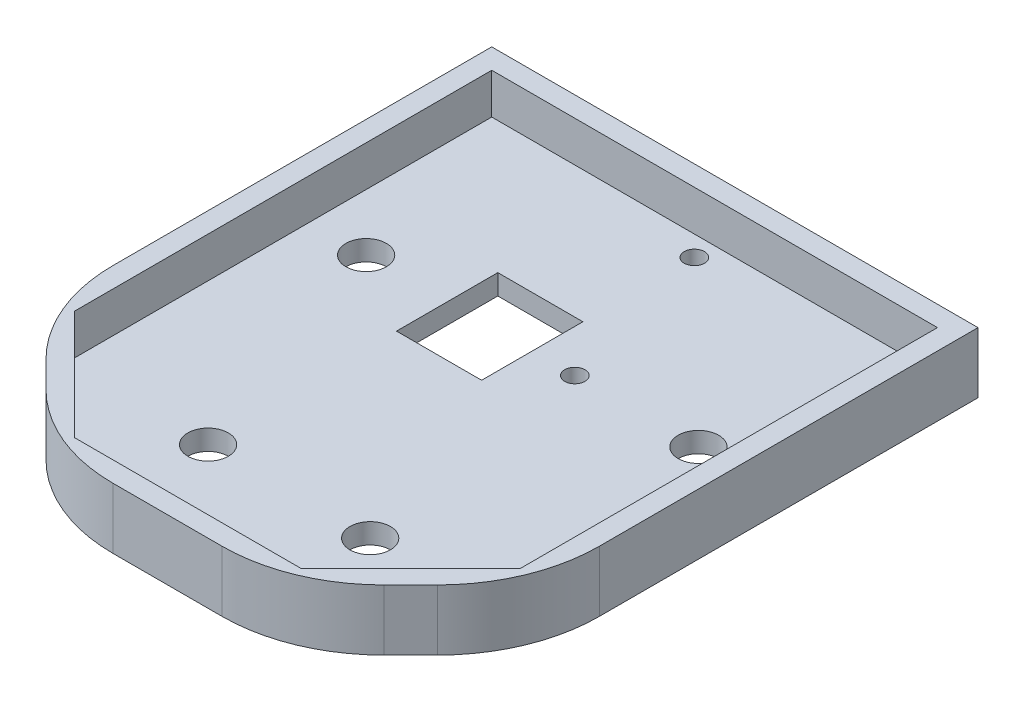
ISO-10303-21;
HEADER;
FILE_DESCRIPTION(('STEP AP214'),'2;1');
FILE_NAME('part.step','',(''),(''),'','','');
FILE_SCHEMA(('AUTOMOTIVE_DESIGN { 1 0 10303 214 1 1 1 1 }'));
ENDSEC;
DATA;
#1=APPLICATION_CONTEXT('core data for automotive mechanical design processes');
#2=APPLICATION_PROTOCOL_DEFINITION('international standard','automotive_design',2000,#1);
#3=PRODUCT_CONTEXT('',#1,'mechanical');
#4=PRODUCT('Part','Part','',(#3));
#5=PRODUCT_RELATED_PRODUCT_CATEGORY('part','',(#4));
#6=PRODUCT_DEFINITION_FORMATION('','',#4);
#7=PRODUCT_DEFINITION_CONTEXT('part definition',#1,'design');
#8=PRODUCT_DEFINITION('design','',#6,#7);
#9=PRODUCT_DEFINITION_SHAPE('','',#8);
#10=(LENGTH_UNIT() NAMED_UNIT(*) SI_UNIT(.MILLI.,.METRE.));
#11=(NAMED_UNIT(*) PLANE_ANGLE_UNIT() SI_UNIT($,.RADIAN.));
#12=(NAMED_UNIT(*) SI_UNIT($,.STERADIAN.) SOLID_ANGLE_UNIT());
#13=UNCERTAINTY_MEASURE_WITH_UNIT(LENGTH_MEASURE(1.E-05),#10,'distance_accuracy_value','');
#14=(GEOMETRIC_REPRESENTATION_CONTEXT(3) GLOBAL_UNCERTAINTY_ASSIGNED_CONTEXT((#13)) GLOBAL_UNIT_ASSIGNED_CONTEXT((#10,
#11,#12)) REPRESENTATION_CONTEXT('',''));
#15=CARTESIAN_POINT('',(0.,0.,0.));
#16=DIRECTION('',(0.,0.,1.));
#17=DIRECTION('',(1.,0.,0.));
#18=AXIS2_PLACEMENT_3D('',#15,#16,#17);
#19=CARTESIAN_POINT('',(0.,6.35,0.));
#20=DIRECTION('',(0.,1.,0.));
#21=DIRECTION('',(0.,0.,1.));
#22=AXIS2_PLACEMENT_3D('',#19,#20,#21);
#23=PLANE('',#22);
#24=DIRECTION('',(1.,0.,0.));
#25=VECTOR('',#24,1.);
#26=CARTESIAN_POINT('',(0.,6.35,-82.55));
#27=LINE('',#26,#25);
#28=CARTESIAN_POINT('',(-69.85,6.35,-82.55));
#29=VERTEX_POINT('',#28);
#30=CARTESIAN_POINT('',(69.85,6.35,-82.55));
#31=VERTEX_POINT('',#30);
#32=EDGE_CURVE('E249',#29,#31,#27,.T.);
#33=ORIENTED_EDGE('',*,*,#32,.F.);
#34=DIRECTION('',(0.,0.,-1.));
#35=VECTOR('',#34,1.);
#36=CARTESIAN_POINT('',(-69.85,6.35,0.));
#37=LINE('',#36,#35);
#38=CARTESIAN_POINT('',(-69.85,6.35,48.1697438789309));
#39=VERTEX_POINT('',#38);
#40=EDGE_CURVE('E193',#39,#29,#37,.T.);
#41=ORIENTED_EDGE('',*,*,#40,.F.);
#42=DIRECTION('',(-0.707106781186547,0.,-0.707106781186548));
#43=VECTOR('',#42,1.);
#44=CARTESIAN_POINT('',(-59.0098719394654,6.35,59.0098719394654));
#45=LINE('',#44,#43);
#46=CARTESIAN_POINT('',(-35.4697438789308,6.35,82.55));
#47=VERTEX_POINT('',#46);
#48=EDGE_CURVE('E245',#47,#39,#45,.T.);
#49=ORIENTED_EDGE('',*,*,#48,.F.);
#50=DIRECTION('',(-1.,0.,0.));
#51=VECTOR('',#50,1.);
#52=CARTESIAN_POINT('',(0.,6.35,82.55));
#53=LINE('',#52,#51);
#54=CARTESIAN_POINT('',(35.4697438789309,6.35,82.55));
#55=VERTEX_POINT('',#54);
#56=EDGE_CURVE('E242',#55,#47,#53,.T.);
#57=ORIENTED_EDGE('',*,*,#56,.F.);
#58=DIRECTION('',(-0.707106781186548,0.,0.707106781186548));
#59=VECTOR('',#58,1.);
#60=CARTESIAN_POINT('',(59.0098719394655,6.35,59.0098719394655));
#61=LINE('',#60,#59);
#62=CARTESIAN_POINT('',(69.85,6.35,48.1697438789309));
#63=VERTEX_POINT('',#62);
#64=EDGE_CURVE('E239',#63,#55,#61,.T.);
#65=ORIENTED_EDGE('',*,*,#64,.F.);
#66=DIRECTION('',(0.,0.,1.));
#67=VECTOR('',#66,1.);
#68=CARTESIAN_POINT('',(69.85,6.35,0.));
#69=LINE('',#68,#67);
#70=EDGE_CURVE('E236',#31,#63,#69,.T.);
#71=ORIENTED_EDGE('',*,*,#70,.F.);
#72=EDGE_LOOP('',(#33,#41,#49,#57,#65,#71));
#73=FACE_BOUND('',#72,.T.);
#74=DIRECTION('',(-1.,0.,0.));
#75=VECTOR('',#74,1.);
#76=CARTESIAN_POINT('',(-26.67,6.35,-41.275));
#77=LINE('',#76,#75);
#78=CARTESIAN_POINT('',(0.,6.35,-41.275));
#79=VERTEX_POINT('',#78);
#80=CARTESIAN_POINT('',(-26.67,6.35,-41.275));
#81=VERTEX_POINT('',#80);
#82=EDGE_CURVE('E260',#79,#81,#77,.T.);
#83=ORIENTED_EDGE('',*,*,#82,.F.);
#84=DIRECTION('',(0.,0.,-1.));
#85=VECTOR('',#84,1.);
#86=CARTESIAN_POINT('',(0.,6.35,-9.52499999999996));
#87=LINE('',#86,#85);
#88=CARTESIAN_POINT('',(0.,6.35,-9.52499999999996));
#89=VERTEX_POINT('',#88);
#90=EDGE_CURVE('E258',#89,#79,#87,.T.);
#91=ORIENTED_EDGE('',*,*,#90,.F.);
#92=DIRECTION('',(1.,0.,0.));
#93=VECTOR('',#92,1.);
#94=CARTESIAN_POINT('',(-26.67,6.35,-9.52499999999996));
#95=LINE('',#94,#93);
#96=CARTESIAN_POINT('',(-26.67,6.35,-9.52499999999996));
#97=VERTEX_POINT('',#96);
#98=EDGE_CURVE('E266',#97,#89,#95,.T.);
#99=ORIENTED_EDGE('',*,*,#98,.F.);
#100=DIRECTION('',(0.,0.,1.));
#101=VECTOR('',#100,1.);
#102=CARTESIAN_POINT('',(-26.67,6.35,-9.52499999999996));
#103=LINE('',#102,#101);
#104=EDGE_CURVE('E263',#81,#97,#103,.T.);
#105=ORIENTED_EDGE('',*,*,#104,.F.);
#106=EDGE_LOOP('',(#83,#91,#99,#105));
#107=FACE_BOUND('',#106,.T.);
#108=CARTESIAN_POINT('',(0.,6.35,-76.1999999999999));
#109=DIRECTION('',(0.,1.,0.));
#110=DIRECTION('',(0.,0.,1.));
#111=AXIS2_PLACEMENT_3D('',#108,#109,#110);
#112=CIRCLE('',#111,3.175);
#113=CARTESIAN_POINT('',(0.,6.35,-73.0249999999999));
#114=VERTEX_POINT('',#113);
#115=EDGE_CURVE('E289',#114,#114,#112,.T.);
#116=ORIENTED_EDGE('',*,*,#115,.F.);
#117=EDGE_LOOP('',(#116));
#118=FACE_BOUND('',#117,.T.);
#119=CARTESIAN_POINT('',(25.4,6.35,50.8));
#120=DIRECTION('',(0.,1.,0.));
#121=DIRECTION('',(0.,0.,1.));
#122=AXIS2_PLACEMENT_3D('',#119,#120,#121);
#123=CIRCLE('',#122,6.35000000000001);
#124=CARTESIAN_POINT('',(25.4,6.35,57.15));
#125=VERTEX_POINT('',#124);
#126=EDGE_CURVE('E301',#125,#125,#123,.T.);
#127=ORIENTED_EDGE('',*,*,#126,.F.);
#128=EDGE_LOOP('',(#127));
#129=FACE_BOUND('',#128,.T.);
#130=CARTESIAN_POINT('',(52.07,6.35,-25.4));
#131=DIRECTION('',(0.,1.,0.));
#132=DIRECTION('',(0.,0.,1.));
#133=AXIS2_PLACEMENT_3D('',#130,#131,#132);
#134=CIRCLE('',#133,6.35);
#135=CARTESIAN_POINT('',(52.07,6.35,-19.05));
#136=VERTEX_POINT('',#135);
#137=EDGE_CURVE('E313',#136,#136,#134,.T.);
#138=ORIENTED_EDGE('',*,*,#137,.F.);
#139=EDGE_LOOP('',(#138));
#140=FACE_BOUND('',#139,.T.);
#141=CARTESIAN_POINT('',(-52.07,6.35,-25.4));
#142=DIRECTION('',(0.,1.,0.));
#143=DIRECTION('',(0.,0.,1.));
#144=AXIS2_PLACEMENT_3D('',#141,#142,#143);
#145=CIRCLE('',#144,6.35);
#146=CARTESIAN_POINT('',(-52.07,6.35,-19.05));
#147=VERTEX_POINT('',#146);
#148=EDGE_CURVE('E319',#147,#147,#145,.T.);
#149=ORIENTED_EDGE('',*,*,#148,.F.);
#150=EDGE_LOOP('',(#149));
#151=FACE_BOUND('',#150,.T.);
#152=CARTESIAN_POINT('',(-25.4,6.35,50.8));
#153=DIRECTION('',(0.,1.,0.));
#154=DIRECTION('',(0.,0.,1.));
#155=AXIS2_PLACEMENT_3D('',#152,#153,#154);
#156=CIRCLE('',#155,6.35);
#157=CARTESIAN_POINT('',(-25.4,6.35,57.15));
#158=VERTEX_POINT('',#157);
#159=EDGE_CURVE('E307',#158,#158,#156,.T.);
#160=ORIENTED_EDGE('',*,*,#159,.F.);
#161=EDGE_LOOP('',(#160));
#162=FACE_BOUND('',#161,.T.);
#163=CARTESIAN_POINT('',(0.,6.35,76.2));
#164=DIRECTION('',(0.,1.,0.));
#165=DIRECTION('',(0.,0.,1.));
#166=AXIS2_PLACEMENT_3D('',#163,#164,#165);
#167=CIRCLE('',#166,3.175);
#168=CARTESIAN_POINT('',(0.,6.35,79.375));
#169=VERTEX_POINT('',#168);
#170=EDGE_CURVE('E295',#169,#169,#167,.T.);
#171=ORIENTED_EDGE('',*,*,#170,.F.);
#172=EDGE_LOOP('',(#171));
#173=FACE_BOUND('',#172,.T.);
#174=CARTESIAN_POINT('',(13.335,6.35,-25.4));
#175=DIRECTION('',(0.,1.,0.));
#176=DIRECTION('',(0.,0.,1.));
#177=AXIS2_PLACEMENT_3D('',#174,#175,#176);
#178=CIRCLE('',#177,3.175);
#179=CARTESIAN_POINT('',(13.335,6.35,-22.225));
#180=VERTEX_POINT('',#179);
#181=EDGE_CURVE('E252',#180,#180,#178,.T.);
#182=ORIENTED_EDGE('',*,*,#181,.F.);
#183=EDGE_LOOP('',(#182));
#184=FACE_BOUND('',#183,.T.);
#185=ADVANCED_FACE('F37',(#73,#107,#118,#129,#140,#151,#162,#173,#184),#23,.T.);
#186=CARTESIAN_POINT('',(0.,0.,0.));
#187=DIRECTION('',(0.,1.,0.));
#188=DIRECTION('',(0.,0.,1.));
#189=AXIS2_PLACEMENT_3D('',#186,#187,#188);
#190=PLANE('',#189);
#191=CARTESIAN_POINT('',(0.,0.,-76.1999999999999));
#192=DIRECTION('',(0.,1.,0.));
#193=DIRECTION('',(0.,0.,1.));
#194=AXIS2_PLACEMENT_3D('',#191,#192,#193);
#195=CIRCLE('',#194,3.175);
#196=CARTESIAN_POINT('',(0.,0.,-73.0249999999999));
#197=VERTEX_POINT('',#196);
#198=EDGE_CURVE('E288',#197,#197,#195,.T.);
#199=ORIENTED_EDGE('',*,*,#198,.T.);
#200=EDGE_LOOP('',(#199));
#201=FACE_BOUND('',#200,.T.);
#202=CARTESIAN_POINT('',(0.,0.,76.2));
#203=DIRECTION('',(0.,1.,0.));
#204=DIRECTION('',(0.,0.,1.));
#205=AXIS2_PLACEMENT_3D('',#202,#203,#204);
#206=CIRCLE('',#205,3.175);
#207=CARTESIAN_POINT('',(0.,0.,79.375));
#208=VERTEX_POINT('',#207);
#209=EDGE_CURVE('E292',#208,#208,#206,.T.);
#210=ORIENTED_EDGE('',*,*,#209,.T.);
#211=EDGE_LOOP('',(#210));
#212=FACE_BOUND('',#211,.T.);
#213=CARTESIAN_POINT('',(25.4,0.,50.8));
#214=DIRECTION('',(0.,1.,0.));
#215=DIRECTION('',(0.,0.,1.));
#216=AXIS2_PLACEMENT_3D('',#213,#214,#215);
#217=CIRCLE('',#216,6.35000000000001);
#218=CARTESIAN_POINT('',(25.4,0.,57.15));
#219=VERTEX_POINT('',#218);
#220=EDGE_CURVE('E298',#219,#219,#217,.T.);
#221=ORIENTED_EDGE('',*,*,#220,.T.);
#222=EDGE_LOOP('',(#221));
#223=FACE_BOUND('',#222,.T.);
#224=CARTESIAN_POINT('',(-25.4,0.,50.8));
#225=DIRECTION('',(0.,1.,0.));
#226=DIRECTION('',(0.,0.,1.));
#227=AXIS2_PLACEMENT_3D('',#224,#225,#226);
#228=CIRCLE('',#227,6.35);
#229=CARTESIAN_POINT('',(-25.4,0.,57.15));
#230=VERTEX_POINT('',#229);
#231=EDGE_CURVE('E304',#230,#230,#228,.T.);
#232=ORIENTED_EDGE('',*,*,#231,.T.);
#233=EDGE_LOOP('',(#232));
#234=FACE_BOUND('',#233,.T.);
#235=CARTESIAN_POINT('',(52.07,0.,-25.4));
#236=DIRECTION('',(0.,1.,0.));
#237=DIRECTION('',(0.,0.,1.));
#238=AXIS2_PLACEMENT_3D('',#235,#236,#237);
#239=CIRCLE('',#238,6.35);
#240=CARTESIAN_POINT('',(52.07,0.,-19.05));
#241=VERTEX_POINT('',#240);
#242=EDGE_CURVE('E310',#241,#241,#239,.T.);
#243=ORIENTED_EDGE('',*,*,#242,.T.);
#244=EDGE_LOOP('',(#243));
#245=FACE_BOUND('',#244,.T.);
#246=CARTESIAN_POINT('',(-52.07,0.,-25.4));
#247=DIRECTION('',(0.,1.,0.));
#248=DIRECTION('',(0.,0.,1.));
#249=AXIS2_PLACEMENT_3D('',#246,#247,#248);
#250=CIRCLE('',#249,6.35);
#251=CARTESIAN_POINT('',(-52.07,0.,-19.05));
#252=VERTEX_POINT('',#251);
#253=EDGE_CURVE('E316',#252,#252,#250,.T.);
#254=ORIENTED_EDGE('',*,*,#253,.T.);
#255=EDGE_LOOP('',(#254));
#256=FACE_BOUND('',#255,.T.);
#257=DIRECTION('',(0.,0.,-1.));
#258=VECTOR('',#257,1.);
#259=CARTESIAN_POINT('',(0.,0.,-9.52499999999996));
#260=LINE('',#259,#258);
#261=CARTESIAN_POINT('',(0.,0.,-9.52499999999996));
#262=VERTEX_POINT('',#261);
#263=CARTESIAN_POINT('',(0.,0.,-41.275));
#264=VERTEX_POINT('',#263);
#265=EDGE_CURVE('E255',#262,#264,#260,.T.);
#266=ORIENTED_EDGE('',*,*,#265,.T.);
#267=DIRECTION('',(-1.,0.,0.));
#268=VECTOR('',#267,1.);
#269=CARTESIAN_POINT('',(-26.67,0.,-41.275));
#270=LINE('',#269,#268);
#271=CARTESIAN_POINT('',(-26.67,0.,-41.275));
#272=VERTEX_POINT('',#271);
#273=EDGE_CURVE('E271',#264,#272,#270,.T.);
#274=ORIENTED_EDGE('',*,*,#273,.T.);
#275=DIRECTION('',(0.,0.,1.));
#276=VECTOR('',#275,1.);
#277=CARTESIAN_POINT('',(-26.67,0.,-9.52499999999996));
#278=LINE('',#277,#276);
#279=CARTESIAN_POINT('',(-26.67,0.,-9.52499999999996));
#280=VERTEX_POINT('',#279);
#281=EDGE_CURVE('E274',#272,#280,#278,.T.);
#282=ORIENTED_EDGE('',*,*,#281,.T.);
#283=DIRECTION('',(1.,0.,0.));
#284=VECTOR('',#283,1.);
#285=CARTESIAN_POINT('',(-26.67,0.,-9.52499999999996));
#286=LINE('',#285,#284);
#287=EDGE_CURVE('E261',#280,#262,#286,.T.);
#288=ORIENTED_EDGE('',*,*,#287,.T.);
#289=EDGE_LOOP('',(#266,#274,#282,#288));
#290=FACE_BOUND('',#289,.T.);
#291=CARTESIAN_POINT('',(13.335,0.,-25.4));
#292=DIRECTION('',(0.,1.,0.));
#293=DIRECTION('',(0.,0.,1.));
#294=AXIS2_PLACEMENT_3D('',#291,#292,#293);
#295=CIRCLE('',#294,3.175);
#296=CARTESIAN_POINT('',(13.335,0.,-22.225));
#297=VERTEX_POINT('',#296);
#298=EDGE_CURVE('E251',#297,#297,#295,.T.);
#299=ORIENTED_EDGE('',*,*,#298,.T.);
#300=EDGE_LOOP('',(#299));
#301=FACE_BOUND('',#300,.T.);
#302=DIRECTION('',(0.,0.,-1.));
#303=VECTOR('',#302,1.);
#304=CARTESIAN_POINT('',(76.2,0.,-88.9));
#305=LINE('',#304,#303);
#306=CARTESIAN_POINT('',(76.2,0.,29.7579510314468));
#307=VERTEX_POINT('',#306);
#308=CARTESIAN_POINT('',(76.2,0.,-88.9));
#309=VERTEX_POINT('',#308);
#310=EDGE_CURVE('E335',#307,#309,#305,.T.);
#311=ORIENTED_EDGE('',*,*,#310,.F.);
#312=CARTESIAN_POINT('',(25.4,0.,29.7579510314468));
#313=DIRECTION('',(0.,1.,0.));
#314=DIRECTION('',(0.,0.,1.));
#315=AXIS2_PLACEMENT_3D('',#312,#313,#314);
#316=CIRCLE('',#315,50.8);
#317=CARTESIAN_POINT('',(61.3210244842767,0.,65.6789755157234));
#318=VERTEX_POINT('',#317);
#319=EDGE_CURVE('E354',#307,#318,#316,.F.);
#320=ORIENTED_EDGE('',*,*,#319,.T.);
#321=DIRECTION('',(0.707106781186547,0.,-0.707106781186548));
#322=VECTOR('',#321,1.);
#323=CARTESIAN_POINT('',(38.1000000000001,0.,88.9));
#324=LINE('',#323,#322);
#325=CARTESIAN_POINT('',(52.9789755157234,0.,74.0210244842766));
#326=VERTEX_POINT('',#325);
#327=EDGE_CURVE('E332',#326,#318,#324,.T.);
#328=ORIENTED_EDGE('',*,*,#327,.F.);
#329=CARTESIAN_POINT('',(17.0579510314468,0.,38.1000000000001));
#330=DIRECTION('',(0.,1.,0.));
#331=DIRECTION('',(0.,0.,1.));
#332=AXIS2_PLACEMENT_3D('',#329,#330,#331);
#333=CIRCLE('',#332,50.8);
#334=CARTESIAN_POINT('',(17.0579510314468,0.,88.9));
#335=VERTEX_POINT('',#334);
#336=EDGE_CURVE('E352',#326,#335,#333,.F.);
#337=ORIENTED_EDGE('',*,*,#336,.T.);
#338=DIRECTION('',(1.,0.,0.));
#339=VECTOR('',#338,1.);
#340=CARTESIAN_POINT('',(-38.1,0.,88.9));
#341=LINE('',#340,#339);
#342=CARTESIAN_POINT('',(-17.0579510314468,0.,88.9));
#343=VERTEX_POINT('',#342);
#344=EDGE_CURVE('E330',#343,#335,#341,.T.);
#345=ORIENTED_EDGE('',*,*,#344,.F.);
#346=CARTESIAN_POINT('',(-17.0579510314468,0.,38.1));
#347=DIRECTION('',(0.,1.,0.));
#348=DIRECTION('',(0.,0.,1.));
#349=AXIS2_PLACEMENT_3D('',#346,#347,#348);
#350=CIRCLE('',#349,50.8);
#351=CARTESIAN_POINT('',(-52.9789755157234,0.,74.0210244842767));
#352=VERTEX_POINT('',#351);
#353=EDGE_CURVE('E350',#343,#352,#350,.F.);
#354=ORIENTED_EDGE('',*,*,#353,.T.);
#355=DIRECTION('',(0.707106781186547,0.,0.707106781186547));
#356=VECTOR('',#355,1.);
#357=CARTESIAN_POINT('',(-76.2,0.,50.8));
#358=LINE('',#357,#356);
#359=CARTESIAN_POINT('',(-61.3210244842766,0.,65.6789755157234));
#360=VERTEX_POINT('',#359);
#361=EDGE_CURVE('E327',#360,#352,#358,.T.);
#362=ORIENTED_EDGE('',*,*,#361,.F.);
#363=CARTESIAN_POINT('',(-25.4,0.,29.7579510314468));
#364=DIRECTION('',(0.,1.,0.));
#365=DIRECTION('',(0.,0.,1.));
#366=AXIS2_PLACEMENT_3D('',#363,#364,#365);
#367=CIRCLE('',#366,50.8);
#368=CARTESIAN_POINT('',(-76.2,0.,29.7579510314468));
#369=VERTEX_POINT('',#368);
#370=EDGE_CURVE('E348',#360,#369,#367,.F.);
#371=ORIENTED_EDGE('',*,*,#370,.T.);
#372=DIRECTION('',(0.,0.,1.));
#373=VECTOR('',#372,1.);
#374=CARTESIAN_POINT('',(-76.2,0.,-88.8999999999999));
#375=LINE('',#374,#373);
#376=CARTESIAN_POINT('',(-76.2,0.,-88.8999999999999));
#377=VERTEX_POINT('',#376);
#378=EDGE_CURVE('E322',#377,#369,#375,.T.);
#379=ORIENTED_EDGE('',*,*,#378,.F.);
#380=DIRECTION('',(-1.,0.,0.));
#381=VECTOR('',#380,1.);
#382=CARTESIAN_POINT('',(-76.2,0.,-88.8999999999999));
#383=LINE('',#382,#381);
#384=EDGE_CURVE('E337',#309,#377,#383,.T.);
#385=ORIENTED_EDGE('',*,*,#384,.F.);
#386=EDGE_LOOP('',(#311,#320,#328,#337,#345,#354,#362,#371,#379,#385));
#387=FACE_BOUND('',#386,.T.);
#388=ADVANCED_FACE('F388',(#201,#212,#223,#234,#245,#256,#290,#301,#387),#190,.F.);
#389=CARTESIAN_POINT('',(-76.2,6.35,-88.8999999999999));
#390=DIRECTION('',(1.,0.,0.));
#391=DIRECTION('',(0.,0.,-1.));
#392=AXIS2_PLACEMENT_3D('',#389,#390,#391);
#393=PLANE('',#392);
#394=ORIENTED_EDGE('',*,*,#378,.T.);
#395=DIRECTION('',(0.,-1.,0.));
#396=VECTOR('',#395,1.);
#397=CARTESIAN_POINT('',(-76.2,6.35,29.7579510314468));
#398=LINE('',#397,#396);
#399=CARTESIAN_POINT('',(-76.2,19.05,29.7579510314468));
#400=VERTEX_POINT('',#399);
#401=EDGE_CURVE('E11',#369,#400,#398,.F.);
#402=ORIENTED_EDGE('',*,*,#401,.T.);
#403=DIRECTION('',(0.,0.,1.));
#404=VECTOR('',#403,1.);
#405=CARTESIAN_POINT('',(-76.2,19.05,-88.8999999999999));
#406=LINE('',#405,#404);
#407=CARTESIAN_POINT('',(-76.2,19.05,-88.8999999999999));
#408=VERTEX_POINT('',#407);
#409=EDGE_CURVE('E224',#408,#400,#406,.T.);
#410=ORIENTED_EDGE('',*,*,#409,.F.);
#411=DIRECTION('',(0.,-1.,0.));
#412=VECTOR('',#411,1.);
#413=CARTESIAN_POINT('',(-76.2,6.35,-88.8999999999999));
#414=LINE('',#413,#412);
#415=EDGE_CURVE('E339',#408,#377,#414,.T.);
#416=ORIENTED_EDGE('',*,*,#415,.T.);
#417=EDGE_LOOP('',(#394,#402,#410,#416));
#418=FACE_BOUND('',#417,.T.);
#419=ADVANCED_FACE('F413',(#418),#393,.F.);
#420=CARTESIAN_POINT('',(-76.2,6.35,50.8));
#421=DIRECTION('',(0.707106781186548,0.,-0.707106781186548));
#422=DIRECTION('',(-0.707106781186548,0.,-0.707106781186548));
#423=AXIS2_PLACEMENT_3D('',#420,#421,#422);
#424=PLANE('',#423);
#425=ORIENTED_EDGE('',*,*,#361,.T.);
#426=DIRECTION('',(0.,-1.,0.));
#427=VECTOR('',#426,1.);
#428=CARTESIAN_POINT('',(-52.9789755157234,6.35,74.0210244842767));
#429=LINE('',#428,#427);
#430=CARTESIAN_POINT('',(-52.9789755157234,19.05,74.0210244842767));
#431=VERTEX_POINT('',#430);
#432=EDGE_CURVE('E45',#352,#431,#429,.F.);
#433=ORIENTED_EDGE('',*,*,#432,.T.);
#434=DIRECTION('',(0.707106781186547,0.,0.707106781186547));
#435=VECTOR('',#434,1.);
#436=CARTESIAN_POINT('',(-76.2,19.05,50.8));
#437=LINE('',#436,#435);
#438=CARTESIAN_POINT('',(-61.3210244842766,19.05,65.6789755157234));
#439=VERTEX_POINT('',#438);
#440=EDGE_CURVE('E227',#439,#431,#437,.T.);
#441=ORIENTED_EDGE('',*,*,#440,.F.);
#442=DIRECTION('',(0.,-1.,0.));
#443=VECTOR('',#442,1.);
#444=CARTESIAN_POINT('',(-61.3210244842766,6.35,65.6789755157234));
#445=LINE('',#444,#443);
#446=EDGE_CURVE('E372',#439,#360,#445,.T.);
#447=ORIENTED_EDGE('',*,*,#446,.T.);
#448=EDGE_LOOP('',(#425,#433,#441,#447));
#449=FACE_BOUND('',#448,.T.);
#450=ADVANCED_FACE('F377',(#449),#424,.F.);
#451=CARTESIAN_POINT('',(-38.1,6.35,88.9));
#452=DIRECTION('',(0.,0.,-1.));
#453=DIRECTION('',(-1.,0.,0.));
#454=AXIS2_PLACEMENT_3D('',#451,#452,#453);
#455=PLANE('',#454);
#456=ORIENTED_EDGE('',*,*,#344,.T.);
#457=DIRECTION('',(0.,-1.,0.));
#458=VECTOR('',#457,1.);
#459=CARTESIAN_POINT('',(17.0579510314468,6.35,88.9));
#460=LINE('',#459,#458);
#461=CARTESIAN_POINT('',(17.0579510314468,19.05,88.9));
#462=VERTEX_POINT('',#461);
#463=EDGE_CURVE('E52',#335,#462,#460,.F.);
#464=ORIENTED_EDGE('',*,*,#463,.T.);
#465=DIRECTION('',(1.,0.,0.));
#466=VECTOR('',#465,1.);
#467=CARTESIAN_POINT('',(-38.1,19.05,88.9));
#468=LINE('',#467,#466);
#469=CARTESIAN_POINT('',(-17.0579510314468,19.05,88.9));
#470=VERTEX_POINT('',#469);
#471=EDGE_CURVE('E229',#470,#462,#468,.T.);
#472=ORIENTED_EDGE('',*,*,#471,.F.);
#473=DIRECTION('',(0.,-1.,0.));
#474=VECTOR('',#473,1.);
#475=CARTESIAN_POINT('',(-17.0579510314468,6.35,88.9));
#476=LINE('',#475,#474);
#477=EDGE_CURVE('E368',#470,#343,#476,.T.);
#478=ORIENTED_EDGE('',*,*,#477,.T.);
#479=EDGE_LOOP('',(#456,#464,#472,#478));
#480=FACE_BOUND('',#479,.T.);
#481=ADVANCED_FACE('F385',(#480),#455,.F.);
#482=CARTESIAN_POINT('',(38.1000000000001,6.35,88.9));
#483=DIRECTION('',(-0.707106781186548,0.,-0.707106781186547));
#484=DIRECTION('',(-0.707106781186547,0.,0.707106781186548));
#485=AXIS2_PLACEMENT_3D('',#482,#483,#484);
#486=PLANE('',#485);
#487=ORIENTED_EDGE('',*,*,#327,.T.);
#488=DIRECTION('',(0.,-1.,0.));
#489=VECTOR('',#488,1.);
#490=CARTESIAN_POINT('',(61.3210244842767,6.35,65.6789755157234));
#491=LINE('',#490,#489);
#492=CARTESIAN_POINT('',(61.3210244842767,19.05,65.6789755157234));
#493=VERTEX_POINT('',#492);
#494=EDGE_CURVE('E359',#318,#493,#491,.F.);
#495=ORIENTED_EDGE('',*,*,#494,.T.);
#496=DIRECTION('',(0.707106781186547,0.,-0.707106781186548));
#497=VECTOR('',#496,1.);
#498=CARTESIAN_POINT('',(38.1000000000001,19.05,88.9));
#499=LINE('',#498,#497);
#500=CARTESIAN_POINT('',(52.9789755157234,19.05,74.0210244842766));
#501=VERTEX_POINT('',#500);
#502=EDGE_CURVE('E231',#501,#493,#499,.T.);
#503=ORIENTED_EDGE('',*,*,#502,.F.);
#504=DIRECTION('',(0.,-1.,0.));
#505=VECTOR('',#504,1.);
#506=CARTESIAN_POINT('',(52.9789755157234,6.35,74.0210244842766));
#507=LINE('',#506,#505);
#508=EDGE_CURVE('E356',#501,#326,#507,.T.);
#509=ORIENTED_EDGE('',*,*,#508,.T.);
#510=EDGE_LOOP('',(#487,#495,#503,#509));
#511=FACE_BOUND('',#510,.T.);
#512=ADVANCED_FACE('F396',(#511),#486,.F.);
#513=CARTESIAN_POINT('',(76.2,6.35,-88.9));
#514=DIRECTION('',(-1.,0.,0.));
#515=DIRECTION('',(0.,0.,1.));
#516=AXIS2_PLACEMENT_3D('',#513,#514,#515);
#517=PLANE('',#516);
#518=DIRECTION('',(0.,0.,-1.));
#519=VECTOR('',#518,1.);
#520=CARTESIAN_POINT('',(76.2,19.05,50.8));
#521=LINE('',#520,#519);
#522=CARTESIAN_POINT('',(76.2,19.05,29.7579510314468));
#523=VERTEX_POINT('',#522);
#524=CARTESIAN_POINT('',(76.2,19.05,-88.9));
#525=VERTEX_POINT('',#524);
#526=EDGE_CURVE('E234',#523,#525,#521,.T.);
#527=ORIENTED_EDGE('',*,*,#526,.F.);
#528=DIRECTION('',(0.,-1.,0.));
#529=VECTOR('',#528,1.);
#530=CARTESIAN_POINT('',(76.2,6.35,29.7579510314468));
#531=LINE('',#530,#529);
#532=EDGE_CURVE('E345',#523,#307,#531,.T.);
#533=ORIENTED_EDGE('',*,*,#532,.T.);
#534=ORIENTED_EDGE('',*,*,#310,.T.);
#535=DIRECTION('',(0.,-1.,0.));
#536=VECTOR('',#535,1.);
#537=CARTESIAN_POINT('',(76.2,6.35,-88.9));
#538=LINE('',#537,#536);
#539=EDGE_CURVE('E342',#525,#309,#538,.T.);
#540=ORIENTED_EDGE('',*,*,#539,.F.);
#541=EDGE_LOOP('',(#527,#533,#534,#540));
#542=FACE_BOUND('',#541,.T.);
#543=ADVANCED_FACE('F404',(#542),#517,.F.);
#544=CARTESIAN_POINT('',(-76.2,6.35,-88.8999999999999));
#545=DIRECTION('',(0.,0.,1.));
#546=DIRECTION('',(1.,0.,0.));
#547=AXIS2_PLACEMENT_3D('',#544,#545,#546);
#548=PLANE('',#547);
#549=ORIENTED_EDGE('',*,*,#384,.T.);
#550=ORIENTED_EDGE('',*,*,#415,.F.);
#551=DIRECTION('',(-1.,0.,0.));
#552=VECTOR('',#551,1.);
#553=CARTESIAN_POINT('',(76.2,19.05,-88.9));
#554=LINE('',#553,#552);
#555=EDGE_CURVE('E194',#525,#408,#554,.T.);
#556=ORIENTED_EDGE('',*,*,#555,.F.);
#557=ORIENTED_EDGE('',*,*,#539,.T.);
#558=EDGE_LOOP('',(#549,#550,#556,#557));
#559=FACE_BOUND('',#558,.T.);
#560=ADVANCED_FACE('F409',(#559),#548,.F.);
#561=CARTESIAN_POINT('',(-52.07,6.35,-25.4));
#562=DIRECTION('',(0.,-1.,0.));
#563=DIRECTION('',(0.,0.,-1.));
#564=AXIS2_PLACEMENT_3D('',#561,#562,#563);
#565=CYLINDRICAL_SURFACE('',#564,6.35);
#566=ORIENTED_EDGE('',*,*,#148,.T.);
#567=EDGE_LOOP('',(#566));
#568=FACE_BOUND('',#567,.T.);
#569=ORIENTED_EDGE('',*,*,#253,.F.);
#570=EDGE_LOOP('',(#569));
#571=FACE_BOUND('',#570,.T.);
#572=ADVANCED_FACE('F430',(#568,#571),#565,.F.);
#573=CARTESIAN_POINT('',(52.07,6.35,-25.4));
#574=DIRECTION('',(0.,-1.,0.));
#575=DIRECTION('',(0.,0.,-1.));
#576=AXIS2_PLACEMENT_3D('',#573,#574,#575);
#577=CYLINDRICAL_SURFACE('',#576,6.35);
#578=ORIENTED_EDGE('',*,*,#137,.T.);
#579=EDGE_LOOP('',(#578));
#580=FACE_BOUND('',#579,.T.);
#581=ORIENTED_EDGE('',*,*,#242,.F.);
#582=EDGE_LOOP('',(#581));
#583=FACE_BOUND('',#582,.T.);
#584=ADVANCED_FACE('F657',(#580,#583),#577,.F.);
#585=CARTESIAN_POINT('',(-25.4,6.35,50.8));
#586=DIRECTION('',(0.,-1.,0.));
#587=DIRECTION('',(0.,0.,-1.));
#588=AXIS2_PLACEMENT_3D('',#585,#586,#587);
#589=CYLINDRICAL_SURFACE('',#588,6.35);
#590=ORIENTED_EDGE('',*,*,#159,.T.);
#591=EDGE_LOOP('',(#590));
#592=FACE_BOUND('',#591,.T.);
#593=ORIENTED_EDGE('',*,*,#231,.F.);
#594=EDGE_LOOP('',(#593));
#595=FACE_BOUND('',#594,.T.);
#596=ADVANCED_FACE('F648',(#592,#595),#589,.F.);
#597=CARTESIAN_POINT('',(25.4,6.35,50.8));
#598=DIRECTION('',(0.,-1.,0.));
#599=DIRECTION('',(0.,0.,-1.));
#600=AXIS2_PLACEMENT_3D('',#597,#598,#599);
#601=CYLINDRICAL_SURFACE('',#600,6.35000000000001);
#602=ORIENTED_EDGE('',*,*,#126,.T.);
#603=EDGE_LOOP('',(#602));
#604=FACE_BOUND('',#603,.T.);
#605=ORIENTED_EDGE('',*,*,#220,.F.);
#606=EDGE_LOOP('',(#605));
#607=FACE_BOUND('',#606,.T.);
#608=ADVANCED_FACE('F639',(#604,#607),#601,.F.);
#609=CARTESIAN_POINT('',(0.,6.35,76.2));
#610=DIRECTION('',(0.,-1.,0.));
#611=DIRECTION('',(0.,0.,-1.));
#612=AXIS2_PLACEMENT_3D('',#609,#610,#611);
#613=CYLINDRICAL_SURFACE('',#612,3.175);
#614=ORIENTED_EDGE('',*,*,#170,.T.);
#615=EDGE_LOOP('',(#614));
#616=FACE_BOUND('',#615,.T.);
#617=ORIENTED_EDGE('',*,*,#209,.F.);
#618=EDGE_LOOP('',(#617));
#619=FACE_BOUND('',#618,.T.);
#620=ADVANCED_FACE('F630',(#616,#619),#613,.F.);
#621=CARTESIAN_POINT('',(0.,6.35,-76.1999999999999));
#622=DIRECTION('',(0.,-1.,0.));
#623=DIRECTION('',(0.,0.,-1.));
#624=AXIS2_PLACEMENT_3D('',#621,#622,#623);
#625=CYLINDRICAL_SURFACE('',#624,3.175);
#626=ORIENTED_EDGE('',*,*,#115,.T.);
#627=EDGE_LOOP('',(#626));
#628=FACE_BOUND('',#627,.T.);
#629=ORIENTED_EDGE('',*,*,#198,.F.);
#630=EDGE_LOOP('',(#629));
#631=FACE_BOUND('',#630,.T.);
#632=ADVANCED_FACE('F621',(#628,#631),#625,.F.);
#633=CARTESIAN_POINT('',(0.,6.35,-9.52499999999996));
#634=DIRECTION('',(-1.,0.,0.));
#635=DIRECTION('',(0.,0.,1.));
#636=AXIS2_PLACEMENT_3D('',#633,#634,#635);
#637=PLANE('',#636);
#638=ORIENTED_EDGE('',*,*,#265,.F.);
#639=DIRECTION('',(0.,-1.,0.));
#640=VECTOR('',#639,1.);
#641=CARTESIAN_POINT('',(0.,6.35,-9.52499999999996));
#642=LINE('',#641,#640);
#643=EDGE_CURVE('E268',#89,#262,#642,.T.);
#644=ORIENTED_EDGE('',*,*,#643,.F.);
#645=ORIENTED_EDGE('',*,*,#90,.T.);
#646=DIRECTION('',(0.,-1.,0.));
#647=VECTOR('',#646,1.);
#648=CARTESIAN_POINT('',(0.,6.35,-41.275));
#649=LINE('',#648,#647);
#650=EDGE_CURVE('E285',#79,#264,#649,.T.);
#651=ORIENTED_EDGE('',*,*,#650,.T.);
#652=EDGE_LOOP('',(#638,#644,#645,#651));
#653=FACE_BOUND('',#652,.T.);
#654=ADVANCED_FACE('F612',(#653),#637,.T.);
#655=CARTESIAN_POINT('',(-26.67,6.35,-41.275));
#656=DIRECTION('',(0.,0.,1.));
#657=DIRECTION('',(1.,0.,0.));
#658=AXIS2_PLACEMENT_3D('',#655,#656,#657);
#659=PLANE('',#658);
#660=ORIENTED_EDGE('',*,*,#273,.F.);
#661=ORIENTED_EDGE('',*,*,#650,.F.);
#662=ORIENTED_EDGE('',*,*,#82,.T.);
#663=DIRECTION('',(0.,-1.,0.));
#664=VECTOR('',#663,1.);
#665=CARTESIAN_POINT('',(-26.67,6.35,-41.275));
#666=LINE('',#665,#664);
#667=EDGE_CURVE('E283',#81,#272,#666,.T.);
#668=ORIENTED_EDGE('',*,*,#667,.T.);
#669=EDGE_LOOP('',(#660,#661,#662,#668));
#670=FACE_BOUND('',#669,.T.);
#671=ADVANCED_FACE('F603',(#670),#659,.T.);
#672=CARTESIAN_POINT('',(-26.67,6.35,-9.52499999999996));
#673=DIRECTION('',(1.,0.,0.));
#674=DIRECTION('',(0.,0.,-1.));
#675=AXIS2_PLACEMENT_3D('',#672,#673,#674);
#676=PLANE('',#675);
#677=ORIENTED_EDGE('',*,*,#281,.F.);
#678=ORIENTED_EDGE('',*,*,#667,.F.);
#679=ORIENTED_EDGE('',*,*,#104,.T.);
#680=DIRECTION('',(0.,-1.,0.));
#681=VECTOR('',#680,1.);
#682=CARTESIAN_POINT('',(-26.67,6.35,-9.52499999999996));
#683=LINE('',#682,#681);
#684=EDGE_CURVE('E281',#97,#280,#683,.T.);
#685=ORIENTED_EDGE('',*,*,#684,.T.);
#686=EDGE_LOOP('',(#677,#678,#679,#685));
#687=FACE_BOUND('',#686,.T.);
#688=ADVANCED_FACE('F594',(#687),#676,.T.);
#689=CARTESIAN_POINT('',(-26.67,6.35,-9.52499999999996));
#690=DIRECTION('',(0.,0.,-1.));
#691=DIRECTION('',(-1.,0.,0.));
#692=AXIS2_PLACEMENT_3D('',#689,#690,#691);
#693=PLANE('',#692);
#694=ORIENTED_EDGE('',*,*,#287,.F.);
#695=ORIENTED_EDGE('',*,*,#684,.F.);
#696=ORIENTED_EDGE('',*,*,#98,.T.);
#697=ORIENTED_EDGE('',*,*,#643,.T.);
#698=EDGE_LOOP('',(#694,#695,#696,#697));
#699=FACE_BOUND('',#698,.T.);
#700=ADVANCED_FACE('F585',(#699),#693,.T.);
#701=CARTESIAN_POINT('',(13.335,6.35,-25.4));
#702=DIRECTION('',(0.,-1.,0.));
#703=DIRECTION('',(0.,0.,-1.));
#704=AXIS2_PLACEMENT_3D('',#701,#702,#703);
#705=CYLINDRICAL_SURFACE('',#704,3.175);
#706=ORIENTED_EDGE('',*,*,#181,.T.);
#707=EDGE_LOOP('',(#706));
#708=FACE_BOUND('',#707,.T.);
#709=ORIENTED_EDGE('',*,*,#298,.F.);
#710=EDGE_LOOP('',(#709));
#711=FACE_BOUND('',#710,.T.);
#712=ADVANCED_FACE('F528',(#708,#711),#705,.F.);
#713=CARTESIAN_POINT('',(0.,19.05,0.));
#714=DIRECTION('',(0.,1.,0.));
#715=DIRECTION('',(0.,0.,1.));
#716=AXIS2_PLACEMENT_3D('',#713,#714,#715);
#717=PLANE('',#716);
#718=ORIENTED_EDGE('',*,*,#502,.T.);
#719=CARTESIAN_POINT('',(25.4,19.05,29.7579510314468));
#720=DIRECTION('',(0.,1.,0.));
#721=DIRECTION('',(0.,0.,1.));
#722=AXIS2_PLACEMENT_3D('',#719,#720,#721);
#723=CIRCLE('',#722,50.8);
#724=EDGE_CURVE('E366',#493,#523,#723,.T.);
#725=ORIENTED_EDGE('',*,*,#724,.T.);
#726=ORIENTED_EDGE('',*,*,#526,.T.);
#727=ORIENTED_EDGE('',*,*,#555,.T.);
#728=ORIENTED_EDGE('',*,*,#409,.T.);
#729=CARTESIAN_POINT('',(-25.4,19.05,29.7579510314468));
#730=DIRECTION('',(0.,1.,0.));
#731=DIRECTION('',(0.,0.,1.));
#732=AXIS2_PLACEMENT_3D('',#729,#730,#731);
#733=CIRCLE('',#732,50.8);
#734=EDGE_CURVE('E361',#400,#439,#733,.T.);
#735=ORIENTED_EDGE('',*,*,#734,.T.);
#736=ORIENTED_EDGE('',*,*,#440,.T.);
#737=CARTESIAN_POINT('',(-17.0579510314468,19.05,38.1));
#738=DIRECTION('',(0.,1.,0.));
#739=DIRECTION('',(0.,0.,1.));
#740=AXIS2_PLACEMENT_3D('',#737,#738,#739);
#741=CIRCLE('',#740,50.8);
#742=EDGE_CURVE('E59',#431,#470,#741,.T.);
#743=ORIENTED_EDGE('',*,*,#742,.T.);
#744=ORIENTED_EDGE('',*,*,#471,.T.);
#745=CARTESIAN_POINT('',(17.0579510314468,19.05,38.1000000000001));
#746=DIRECTION('',(0.,1.,0.));
#747=DIRECTION('',(0.,0.,1.));
#748=AXIS2_PLACEMENT_3D('',#745,#746,#747);
#749=CIRCLE('',#748,50.8);
#750=EDGE_CURVE('E364',#462,#501,#749,.T.);
#751=ORIENTED_EDGE('',*,*,#750,.T.);
#752=EDGE_LOOP('',(#718,#725,#726,#727,#728,#735,#736,#743,#744,#751));
#753=FACE_BOUND('',#752,.T.);
#754=DIRECTION('',(0.,0.,1.));
#755=VECTOR('',#754,1.);
#756=CARTESIAN_POINT('',(-69.85,19.05,-82.55));
#757=LINE('',#756,#755);
#758=CARTESIAN_POINT('',(-69.85,19.05,-82.55));
#759=VERTEX_POINT('',#758);
#760=CARTESIAN_POINT('',(-69.85,19.05,48.1697438789309));
#761=VERTEX_POINT('',#760);
#762=EDGE_CURVE('E186',#759,#761,#757,.T.);
#763=ORIENTED_EDGE('',*,*,#762,.F.);
#764=DIRECTION('',(-1.,0.,0.));
#765=VECTOR('',#764,1.);
#766=CARTESIAN_POINT('',(69.85,19.05,-82.55));
#767=LINE('',#766,#765);
#768=CARTESIAN_POINT('',(69.85,19.05,-82.55));
#769=VERTEX_POINT('',#768);
#770=EDGE_CURVE('E176',#769,#759,#767,.T.);
#771=ORIENTED_EDGE('',*,*,#770,.F.);
#772=DIRECTION('',(0.,0.,-1.));
#773=VECTOR('',#772,1.);
#774=CARTESIAN_POINT('',(69.85,19.05,48.1697438789309));
#775=LINE('',#774,#773);
#776=CARTESIAN_POINT('',(69.85,19.05,48.1697438789309));
#777=VERTEX_POINT('',#776);
#778=EDGE_CURVE('E209',#777,#769,#775,.T.);
#779=ORIENTED_EDGE('',*,*,#778,.F.);
#780=DIRECTION('',(0.707106781186547,0.,-0.707106781186547));
#781=VECTOR('',#780,1.);
#782=CARTESIAN_POINT('',(35.4697438789309,19.05,82.55));
#783=LINE('',#782,#781);
#784=CARTESIAN_POINT('',(35.4697438789309,19.05,82.55));
#785=VERTEX_POINT('',#784);
#786=EDGE_CURVE('E206',#785,#777,#783,.T.);
#787=ORIENTED_EDGE('',*,*,#786,.F.);
#788=DIRECTION('',(1.,0.,0.));
#789=VECTOR('',#788,1.);
#790=CARTESIAN_POINT('',(-35.4697438789308,19.05,82.55));
#791=LINE('',#790,#789);
#792=CARTESIAN_POINT('',(-35.4697438789308,19.05,82.55));
#793=VERTEX_POINT('',#792);
#794=EDGE_CURVE('E202',#793,#785,#791,.T.);
#795=ORIENTED_EDGE('',*,*,#794,.F.);
#796=DIRECTION('',(0.707106781186547,0.,0.707106781186548));
#797=VECTOR('',#796,1.);
#798=CARTESIAN_POINT('',(-69.85,19.05,48.1697438789309));
#799=LINE('',#798,#797);
#800=EDGE_CURVE('E200',#761,#793,#799,.T.);
#801=ORIENTED_EDGE('',*,*,#800,.F.);
#802=EDGE_LOOP('',(#763,#771,#779,#787,#795,#801));
#803=FACE_BOUND('',#802,.T.);
#804=ADVANCED_FACE('F198',(#753,#803),#717,.T.);
#805=CARTESIAN_POINT('',(69.85,19.05,-82.55));
#806=DIRECTION('',(0.,0.,1.));
#807=DIRECTION('',(1.,0.,0.));
#808=AXIS2_PLACEMENT_3D('',#805,#806,#807);
#809=PLANE('',#808);
#810=DIRECTION('',(0.,-1.,0.));
#811=VECTOR('',#810,1.);
#812=CARTESIAN_POINT('',(-69.85,19.05,-82.55));
#813=LINE('',#812,#811);
#814=EDGE_CURVE('E180',#759,#29,#813,.T.);
#815=ORIENTED_EDGE('',*,*,#814,.T.);
#816=ORIENTED_EDGE('',*,*,#32,.T.);
#817=DIRECTION('',(0.,-1.,0.));
#818=VECTOR('',#817,1.);
#819=CARTESIAN_POINT('',(69.85,19.05,-82.55));
#820=LINE('',#819,#818);
#821=EDGE_CURVE('E182',#769,#31,#820,.T.);
#822=ORIENTED_EDGE('',*,*,#821,.F.);
#823=ORIENTED_EDGE('',*,*,#770,.T.);
#824=EDGE_LOOP('',(#815,#816,#822,#823));
#825=FACE_BOUND('',#824,.T.);
#826=ADVANCED_FACE('F178',(#825),#809,.T.);
#827=CARTESIAN_POINT('',(-69.85,19.05,-82.55));
#828=DIRECTION('',(1.,0.,0.));
#829=DIRECTION('',(0.,0.,-1.));
#830=AXIS2_PLACEMENT_3D('',#827,#828,#829);
#831=PLANE('',#830);
#832=DIRECTION('',(0.,-1.,0.));
#833=VECTOR('',#832,1.);
#834=CARTESIAN_POINT('',(-69.85,19.05,48.1697438789309));
#835=LINE('',#834,#833);
#836=EDGE_CURVE('E195',#761,#39,#835,.T.);
#837=ORIENTED_EDGE('',*,*,#836,.T.);
#838=ORIENTED_EDGE('',*,*,#40,.T.);
#839=ORIENTED_EDGE('',*,*,#814,.F.);
#840=ORIENTED_EDGE('',*,*,#762,.T.);
#841=EDGE_LOOP('',(#837,#838,#839,#840));
#842=FACE_BOUND('',#841,.T.);
#843=ADVANCED_FACE('F191',(#842),#831,.T.);
#844=CARTESIAN_POINT('',(-69.85,19.05,48.1697438789309));
#845=DIRECTION('',(0.707106781186548,0.,-0.707106781186547));
#846=DIRECTION('',(-0.707106781186547,0.,-0.707106781186548));
#847=AXIS2_PLACEMENT_3D('',#844,#845,#846);
#848=PLANE('',#847);
#849=DIRECTION('',(0.,-1.,0.));
#850=VECTOR('',#849,1.);
#851=CARTESIAN_POINT('',(-35.4697438789308,19.05,82.55));
#852=LINE('',#851,#850);
#853=EDGE_CURVE('E218',#793,#47,#852,.T.);
#854=ORIENTED_EDGE('',*,*,#853,.T.);
#855=ORIENTED_EDGE('',*,*,#48,.T.);
#856=ORIENTED_EDGE('',*,*,#836,.F.);
#857=ORIENTED_EDGE('',*,*,#800,.T.);
#858=EDGE_LOOP('',(#854,#855,#856,#857));
#859=FACE_BOUND('',#858,.T.);
#860=ADVANCED_FACE('F497',(#859),#848,.T.);
#861=CARTESIAN_POINT('',(-35.4697438789308,19.05,82.55));
#862=DIRECTION('',(0.,0.,-1.));
#863=DIRECTION('',(-1.,0.,0.));
#864=AXIS2_PLACEMENT_3D('',#861,#862,#863);
#865=PLANE('',#864);
#866=DIRECTION('',(0.,-1.,0.));
#867=VECTOR('',#866,1.);
#868=CARTESIAN_POINT('',(35.4697438789309,19.05,82.55));
#869=LINE('',#868,#867);
#870=EDGE_CURVE('E215',#785,#55,#869,.T.);
#871=ORIENTED_EDGE('',*,*,#870,.T.);
#872=ORIENTED_EDGE('',*,*,#56,.T.);
#873=ORIENTED_EDGE('',*,*,#853,.F.);
#874=ORIENTED_EDGE('',*,*,#794,.T.);
#875=EDGE_LOOP('',(#871,#872,#873,#874));
#876=FACE_BOUND('',#875,.T.);
#877=ADVANCED_FACE('F488',(#876),#865,.T.);
#878=CARTESIAN_POINT('',(35.4697438789309,19.05,82.55));
#879=DIRECTION('',(-0.707106781186547,0.,-0.707106781186547));
#880=DIRECTION('',(-0.707106781186548,0.,0.707106781186548));
#881=AXIS2_PLACEMENT_3D('',#878,#879,#880);
#882=PLANE('',#881);
#883=DIRECTION('',(0.,-1.,0.));
#884=VECTOR('',#883,1.);
#885=CARTESIAN_POINT('',(69.85,19.05,48.1697438789309));
#886=LINE('',#885,#884);
#887=EDGE_CURVE('E212',#777,#63,#886,.T.);
#888=ORIENTED_EDGE('',*,*,#887,.T.);
#889=ORIENTED_EDGE('',*,*,#64,.T.);
#890=ORIENTED_EDGE('',*,*,#870,.F.);
#891=ORIENTED_EDGE('',*,*,#786,.T.);
#892=EDGE_LOOP('',(#888,#889,#890,#891));
#893=FACE_BOUND('',#892,.T.);
#894=ADVANCED_FACE('F478',(#893),#882,.T.);
#895=CARTESIAN_POINT('',(69.85,19.05,48.1697438789309));
#896=DIRECTION('',(-1.,0.,0.));
#897=DIRECTION('',(0.,0.,1.));
#898=AXIS2_PLACEMENT_3D('',#895,#896,#897);
#899=PLANE('',#898);
#900=ORIENTED_EDGE('',*,*,#821,.T.);
#901=ORIENTED_EDGE('',*,*,#70,.T.);
#902=ORIENTED_EDGE('',*,*,#887,.F.);
#903=ORIENTED_EDGE('',*,*,#778,.T.);
#904=EDGE_LOOP('',(#900,#901,#902,#903));
#905=FACE_BOUND('',#904,.T.);
#906=ADVANCED_FACE('F447',(#905),#899,.T.);
#907=CARTESIAN_POINT('',(25.4,6.35,29.7579510314468));
#908=DIRECTION('',(0.,-1.,0.));
#909=DIRECTION('',(0.,0.,-1.));
#910=AXIS2_PLACEMENT_3D('',#907,#908,#909);
#911=CYLINDRICAL_SURFACE('',#910,50.8);
#912=ORIENTED_EDGE('',*,*,#724,.F.);
#913=ORIENTED_EDGE('',*,*,#494,.F.);
#914=ORIENTED_EDGE('',*,*,#319,.F.);
#915=ORIENTED_EDGE('',*,*,#532,.F.);
#916=EDGE_LOOP('',(#912,#913,#914,#915));
#917=FACE_BOUND('',#916,.T.);
#918=ADVANCED_FACE('F402',(#917),#911,.T.);
#919=CARTESIAN_POINT('',(17.0579510314468,6.35,38.1000000000001));
#920=DIRECTION('',(0.,-1.,0.));
#921=DIRECTION('',(0.,0.,-1.));
#922=AXIS2_PLACEMENT_3D('',#919,#920,#921);
#923=CYLINDRICAL_SURFACE('',#922,50.8);
#924=ORIENTED_EDGE('',*,*,#750,.F.);
#925=ORIENTED_EDGE('',*,*,#463,.F.);
#926=ORIENTED_EDGE('',*,*,#336,.F.);
#927=ORIENTED_EDGE('',*,*,#508,.F.);
#928=EDGE_LOOP('',(#924,#925,#926,#927));
#929=FACE_BOUND('',#928,.T.);
#930=ADVANCED_FACE('F393',(#929),#923,.T.);
#931=CARTESIAN_POINT('',(-17.0579510314468,6.35,38.1));
#932=DIRECTION('',(0.,-1.,0.));
#933=DIRECTION('',(0.,0.,-1.));
#934=AXIS2_PLACEMENT_3D('',#931,#932,#933);
#935=CYLINDRICAL_SURFACE('',#934,50.8);
#936=ORIENTED_EDGE('',*,*,#742,.F.);
#937=ORIENTED_EDGE('',*,*,#432,.F.);
#938=ORIENTED_EDGE('',*,*,#353,.F.);
#939=ORIENTED_EDGE('',*,*,#477,.F.);
#940=EDGE_LOOP('',(#936,#937,#938,#939));
#941=FACE_BOUND('',#940,.T.);
#942=ADVANCED_FACE('F383',(#941),#935,.T.);
#943=CARTESIAN_POINT('',(-25.4,6.35,29.7579510314468));
#944=DIRECTION('',(0.,-1.,0.));
#945=DIRECTION('',(0.,0.,-1.));
#946=AXIS2_PLACEMENT_3D('',#943,#944,#945);
#947=CYLINDRICAL_SURFACE('',#946,50.8);
#948=ORIENTED_EDGE('',*,*,#734,.F.);
#949=ORIENTED_EDGE('',*,*,#401,.F.);
#950=ORIENTED_EDGE('',*,*,#370,.F.);
#951=ORIENTED_EDGE('',*,*,#446,.F.);
#952=EDGE_LOOP('',(#948,#949,#950,#951));
#953=FACE_BOUND('',#952,.T.);
#954=ADVANCED_FACE('F39',(#953),#947,.T.);
#955=CLOSED_SHELL('',(#185,#388,#419,#450,#481,#512,#543,#560,#572,#584,#596,#608,#620,#632,
#654,#671,#688,#700,#712,#804,#826,#843,#860,#877,#894,#906,#918,#930,#942,#954));
#956=MANIFOLD_SOLID_BREP('B2',#955);
#957=ADVANCED_BREP_SHAPE_REPRESENTATION('',(#18,#956),#14);
#958=SHAPE_DEFINITION_REPRESENTATION(#9,#957);
ENDSEC;
END-ISO-10303-21;
